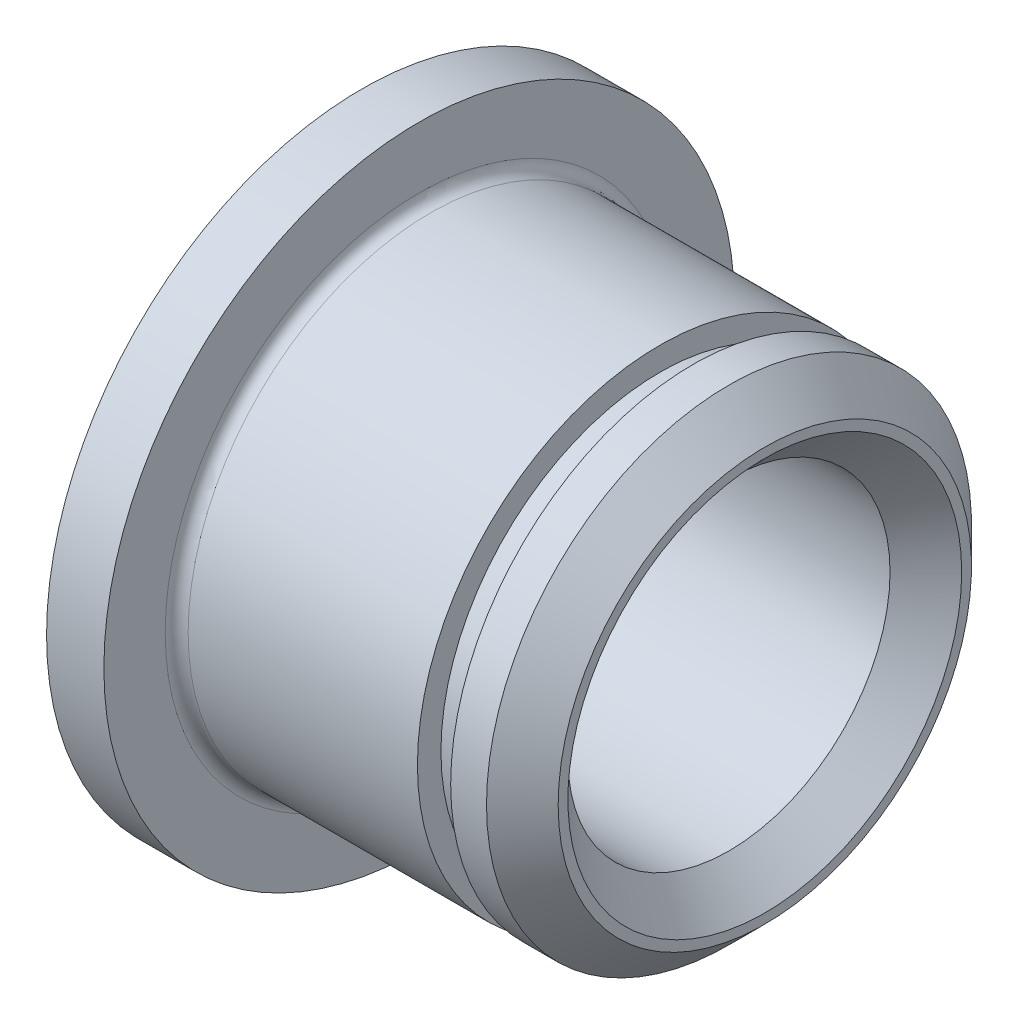
ISO-10303-21;
HEADER;
FILE_DESCRIPTION(('STEP AP214'),'2;1');
FILE_NAME('part.step','',(''),(''),'','','');
FILE_SCHEMA(('AUTOMOTIVE_DESIGN { 1 0 10303 214 1 1 1 1 }'));
ENDSEC;
DATA;
#1=APPLICATION_CONTEXT('core data for automotive mechanical design processes');
#2=APPLICATION_PROTOCOL_DEFINITION('international standard','automotive_design',2000,#1);
#3=PRODUCT_CONTEXT('',#1,'mechanical');
#4=PRODUCT('Part','Part','',(#3));
#5=PRODUCT_RELATED_PRODUCT_CATEGORY('part','',(#4));
#6=PRODUCT_DEFINITION_FORMATION('','',#4);
#7=PRODUCT_DEFINITION_CONTEXT('part definition',#1,'design');
#8=PRODUCT_DEFINITION('design','',#6,#7);
#9=PRODUCT_DEFINITION_SHAPE('','',#8);
#10=(LENGTH_UNIT() NAMED_UNIT(*) SI_UNIT(.MILLI.,.METRE.));
#11=(NAMED_UNIT(*) PLANE_ANGLE_UNIT() SI_UNIT($,.RADIAN.));
#12=(NAMED_UNIT(*) SI_UNIT($,.STERADIAN.) SOLID_ANGLE_UNIT());
#13=UNCERTAINTY_MEASURE_WITH_UNIT(LENGTH_MEASURE(1.E-05),#10,'distance_accuracy_value','');
#14=(GEOMETRIC_REPRESENTATION_CONTEXT(3) GLOBAL_UNCERTAINTY_ASSIGNED_CONTEXT((#13)) GLOBAL_UNIT_ASSIGNED_CONTEXT((#10,
#11,#12)) REPRESENTATION_CONTEXT('',''));
#15=CARTESIAN_POINT('',(0.,0.,0.));
#16=DIRECTION('',(0.,0.,1.));
#17=DIRECTION('',(1.,0.,0.));
#18=AXIS2_PLACEMENT_3D('',#15,#16,#17);
#19=CARTESIAN_POINT('',(7.3406,4.8514,0.));
#20=DIRECTION('',(1.,0.,0.));
#21=DIRECTION('',(0.,0.,-1.));
#22=AXIS2_PLACEMENT_3D('',#19,#20,#21);
#23=PLANE('',#22);
#24=CARTESIAN_POINT('',(7.3406,0.,0.));
#25=DIRECTION('',(-1.,0.,0.));
#26=DIRECTION('',(0.,0.,1.));
#27=AXIS2_PLACEMENT_3D('',#24,#25,#26);
#28=CIRCLE('',#27,5.3721);
#29=CARTESIAN_POINT('',(7.3406,0.,5.3721));
#30=VERTEX_POINT('',#29);
#31=EDGE_CURVE('E162',#30,#30,#28,.F.);
#32=ORIENTED_EDGE('',*,*,#31,.F.);
#33=EDGE_LOOP('',(#32));
#34=FACE_BOUND('',#33,.T.);
#35=CARTESIAN_POINT('',(7.3406,0.,0.));
#36=DIRECTION('',(-1.,0.,0.));
#37=DIRECTION('',(0.,0.,1.));
#38=AXIS2_PLACEMENT_3D('',#35,#36,#37);
#39=CIRCLE('',#38,4.8514);
#40=CARTESIAN_POINT('',(7.3406,0.,4.8514));
#41=VERTEX_POINT('',#40);
#42=EDGE_CURVE('E159',#41,#41,#39,.T.);
#43=ORIENTED_EDGE('',*,*,#42,.F.);
#44=EDGE_LOOP('',(#43));
#45=FACE_BOUND('',#44,.T.);
#46=ADVANCED_FACE('F16',(#34,#45),#23,.F.);
#47=CARTESIAN_POINT('',(0.,0.,0.));
#48=DIRECTION('',(-1.,0.,0.));
#49=DIRECTION('',(0.,0.,1.));
#50=AXIS2_PLACEMENT_3D('',#47,#48,#49);
#51=CYLINDRICAL_SURFACE('',#50,5.3721);
#52=ORIENTED_EDGE('',*,*,#31,.T.);
#53=EDGE_LOOP('',(#52));
#54=FACE_BOUND('',#53,.T.);
#55=CARTESIAN_POINT('',(8.13434999997753,0.,0.));
#56=DIRECTION('',(-1.,0.,0.));
#57=DIRECTION('',(0.,0.,1.));
#58=AXIS2_PLACEMENT_3D('',#55,#56,#57);
#59=CIRCLE('',#58,5.37209999993138);
#60=CARTESIAN_POINT('',(8.13434999997753,0.,5.37209999993138));
#61=VERTEX_POINT('',#60);
#62=EDGE_CURVE('E158',#61,#61,#59,.F.);
#63=ORIENTED_EDGE('',*,*,#62,.F.);
#64=EDGE_LOOP('',(#63));
#65=FACE_BOUND('',#64,.T.);
#66=ADVANCED_FACE('F89',(#54,#65),#51,.T.);
#67=CARTESIAN_POINT('',(0.,0.,0.));
#68=DIRECTION('',(-1.,0.,0.));
#69=DIRECTION('',(0.,0.,1.));
#70=AXIS2_PLACEMENT_3D('',#67,#68,#69);
#71=CYLINDRICAL_SURFACE('',#70,4.8514);
#72=CARTESIAN_POINT('',(6.604,0.,0.));
#73=DIRECTION('',(-1.,0.,0.));
#74=DIRECTION('',(0.,0.,1.));
#75=AXIS2_PLACEMENT_3D('',#72,#73,#74);
#76=CIRCLE('',#75,4.8514);
#77=CARTESIAN_POINT('',(6.604,0.,4.8514));
#78=VERTEX_POINT('',#77);
#79=EDGE_CURVE('E155',#78,#78,#76,.F.);
#80=ORIENTED_EDGE('',*,*,#79,.T.);
#81=EDGE_LOOP('',(#80));
#82=FACE_BOUND('',#81,.T.);
#83=ORIENTED_EDGE('',*,*,#42,.T.);
#84=EDGE_LOOP('',(#83));
#85=FACE_BOUND('',#84,.T.);
#86=ADVANCED_FACE('F86',(#82,#85),#71,.T.);
#87=CARTESIAN_POINT('',(8.13434999997753,0.,0.));
#88=DIRECTION('',(-1.,0.,0.));
#89=DIRECTION('',(0.,0.,1.));
#90=AXIS2_PLACEMENT_3D('',#87,#88,#89);
#91=CONICAL_SURFACE('',#90,5.37209999993138,0.785398163397448);
#92=ORIENTED_EDGE('',*,*,#62,.T.);
#93=EDGE_LOOP('',(#92));
#94=FACE_BOUND('',#93,.T.);
#95=CARTESIAN_POINT('',(8.9280999999346,0.,0.));
#96=DIRECTION('',(-1.,0.,0.));
#97=DIRECTION('',(0.,0.,1.));
#98=AXIS2_PLACEMENT_3D('',#95,#96,#97);
#99=CIRCLE('',#98,4.57834999997431);
#100=CARTESIAN_POINT('',(8.9280999999346,0.,4.57834999997431));
#101=VERTEX_POINT('',#100);
#102=EDGE_CURVE('E152',#101,#101,#99,.T.);
#103=ORIENTED_EDGE('',*,*,#102,.T.);
#104=EDGE_LOOP('',(#103));
#105=FACE_BOUND('',#104,.T.);
#106=ADVANCED_FACE('F82',(#94,#105),#91,.T.);
#107=CARTESIAN_POINT('',(6.604,5.3721,0.));
#108=DIRECTION('',(-1.,0.,0.));
#109=DIRECTION('',(0.,0.,1.));
#110=AXIS2_PLACEMENT_3D('',#107,#108,#109);
#111=PLANE('',#110);
#112=ORIENTED_EDGE('',*,*,#79,.F.);
#113=EDGE_LOOP('',(#112));
#114=FACE_BOUND('',#113,.T.);
#115=CARTESIAN_POINT('',(6.604,0.,0.));
#116=DIRECTION('',(-1.,0.,0.));
#117=DIRECTION('',(0.,0.,1.));
#118=AXIS2_PLACEMENT_3D('',#115,#116,#117);
#119=CIRCLE('',#118,5.3721);
#120=CARTESIAN_POINT('',(6.604,0.,5.3721));
#121=VERTEX_POINT('',#120);
#122=EDGE_CURVE('E149',#121,#121,#119,.T.);
#123=ORIENTED_EDGE('',*,*,#122,.F.);
#124=EDGE_LOOP('',(#123));
#125=FACE_BOUND('',#124,.T.);
#126=ADVANCED_FACE('F78',(#114,#125),#111,.F.);
#127=CARTESIAN_POINT('',(8.9281,4.57835,0.));
#128=DIRECTION('',(-1.,0.,0.));
#129=DIRECTION('',(0.,0.,1.));
#130=AXIS2_PLACEMENT_3D('',#127,#128,#129);
#131=PLANE('',#130);
#132=CARTESIAN_POINT('',(8.92809999999145,0.,0.));
#133=DIRECTION('',(1.,0.,0.));
#134=DIRECTION('',(0.,0.,-1.));
#135=AXIS2_PLACEMENT_3D('',#132,#133,#134);
#136=CIRCLE('',#135,4.36245000003055);
#137=CARTESIAN_POINT('',(8.92809999999145,0.,-4.36245000003055));
#138=VERTEX_POINT('',#137);
#139=EDGE_CURVE('E145',#138,#138,#136,.F.);
#140=ORIENTED_EDGE('',*,*,#139,.T.);
#141=EDGE_LOOP('',(#140));
#142=FACE_BOUND('',#141,.T.);
#143=ORIENTED_EDGE('',*,*,#102,.F.);
#144=EDGE_LOOP('',(#143));
#145=FACE_BOUND('',#144,.T.);
#146=ADVANCED_FACE('F74',(#142,#145),#131,.F.);
#147=CARTESIAN_POINT('',(0.,0.,0.));
#148=DIRECTION('',(-1.,0.,0.));
#149=DIRECTION('',(0.,0.,1.));
#150=AXIS2_PLACEMENT_3D('',#147,#148,#149);
#151=CYLINDRICAL_SURFACE('',#150,5.3721);
#152=CARTESIAN_POINT('',(1.524,0.,0.));
#153=DIRECTION('',(-1.,0.,0.));
#154=DIRECTION('',(0.,0.,1.));
#155=AXIS2_PLACEMENT_3D('',#152,#153,#154);
#156=CIRCLE('',#155,5.3721);
#157=CARTESIAN_POINT('',(1.524,0.,5.3721));
#158=VERTEX_POINT('',#157);
#159=EDGE_CURVE('E148',#158,#158,#156,.F.);
#160=ORIENTED_EDGE('',*,*,#159,.T.);
#161=EDGE_LOOP('',(#160));
#162=FACE_BOUND('',#161,.T.);
#163=ORIENTED_EDGE('',*,*,#122,.T.);
#164=EDGE_LOOP('',(#163));
#165=FACE_BOUND('',#164,.T.);
#166=ADVANCED_FACE('F70',(#162,#165),#151,.T.);
#167=CARTESIAN_POINT('',(8.92809999999145,0.,0.));
#168=DIRECTION('',(1.,0.,0.));
#169=DIRECTION('',(0.,0.,-1.));
#170=AXIS2_PLACEMENT_3D('',#167,#168,#169);
#171=CONICAL_SURFACE('',#170,4.36245000003055,0.785398163397448);
#172=CARTESIAN_POINT('',(8.13435,0.,0.));
#173=DIRECTION('',(-1.,0.,0.));
#174=DIRECTION('',(0.,0.,1.));
#175=AXIS2_PLACEMENT_3D('',#172,#173,#174);
#176=CIRCLE('',#175,3.5687);
#177=CARTESIAN_POINT('',(8.13435,0.,3.5687));
#178=VERTEX_POINT('',#177);
#179=EDGE_CURVE('E41',#178,#178,#176,.T.);
#180=ORIENTED_EDGE('',*,*,#179,.T.);
#181=EDGE_LOOP('',(#180));
#182=FACE_BOUND('',#181,.T.);
#183=ORIENTED_EDGE('',*,*,#139,.F.);
#184=EDGE_LOOP('',(#183));
#185=FACE_BOUND('',#184,.T.);
#186=ADVANCED_FACE('F65',(#182,#185),#171,.F.);
#187=CARTESIAN_POINT('',(1.524,0.,0.));
#188=DIRECTION('',(-1.,0.,0.));
#189=DIRECTION('',(0.,0.,1.));
#190=AXIS2_PLACEMENT_3D('',#187,#188,#189);
#191=TOROIDAL_SURFACE('',#190,5.6261,0.254);
#192=CARTESIAN_POINT('',(1.27,0.,0.));
#193=DIRECTION('',(1.,0.,0.));
#194=DIRECTION('',(0.,0.,-1.));
#195=AXIS2_PLACEMENT_3D('',#192,#193,#194);
#196=CIRCLE('',#195,5.6261);
#197=CARTESIAN_POINT('',(1.27,0.,-5.6261));
#198=VERTEX_POINT('',#197);
#199=CARTESIAN_POINT('',(1.27,0.,5.6261));
#200=VERTEX_POINT('',#199);
#201=EDGE_CURVE('E33',#198,#200,#196,.T.);
#202=ORIENTED_EDGE('',*,*,#201,.T.);
#203=CARTESIAN_POINT('',(1.27,0.,0.));
#204=DIRECTION('',(1.,0.,0.));
#205=DIRECTION('',(0.,0.,1.));
#206=AXIS2_PLACEMENT_3D('',#203,#204,#205);
#207=CIRCLE('',#206,5.6261);
#208=EDGE_CURVE('E36',#200,#198,#207,.T.);
#209=ORIENTED_EDGE('',*,*,#208,.T.);
#210=EDGE_LOOP('',(#202,#209));
#211=FACE_BOUND('',#210,.T.);
#212=ORIENTED_EDGE('',*,*,#159,.F.);
#213=EDGE_LOOP('',(#212));
#214=FACE_BOUND('',#213,.T.);
#215=ADVANCED_FACE('F44',(#211,#214),#191,.F.);
#216=CARTESIAN_POINT('',(0.,0.,0.));
#217=DIRECTION('',(-1.,0.,0.));
#218=DIRECTION('',(0.,0.,1.));
#219=AXIS2_PLACEMENT_3D('',#216,#217,#218);
#220=CYLINDRICAL_SURFACE('',#219,3.5687);
#221=ORIENTED_EDGE('',*,*,#179,.F.);
#222=EDGE_LOOP('',(#221));
#223=FACE_BOUND('',#222,.T.);
#224=CARTESIAN_POINT('',(0.793750000013915,0.,0.));
#225=DIRECTION('',(-1.,0.,0.));
#226=DIRECTION('',(0.,0.,1.));
#227=AXIS2_PLACEMENT_3D('',#224,#225,#226);
#228=CIRCLE('',#227,3.56870000001663);
#229=CARTESIAN_POINT('',(0.793750000013915,0.,3.56870000001663));
#230=VERTEX_POINT('',#229);
#231=EDGE_CURVE('E46',#230,#230,#228,.T.);
#232=ORIENTED_EDGE('',*,*,#231,.T.);
#233=EDGE_LOOP('',(#232));
#234=FACE_BOUND('',#233,.T.);
#235=ADVANCED_FACE('F64',(#223,#234),#220,.F.);
#236=CARTESIAN_POINT('',(1.27,6.985,0.));
#237=DIRECTION('',(-1.,0.,0.));
#238=DIRECTION('',(0.,0.,1.));
#239=AXIS2_PLACEMENT_3D('',#236,#237,#238);
#240=PLANE('',#239);
#241=ORIENTED_EDGE('',*,*,#208,.F.);
#242=ORIENTED_EDGE('',*,*,#201,.F.);
#243=EDGE_LOOP('',(#241,#242));
#244=FACE_BOUND('',#243,.T.);
#245=CARTESIAN_POINT('',(1.27,0.,0.));
#246=DIRECTION('',(-1.,0.,0.));
#247=DIRECTION('',(0.,0.,1.));
#248=AXIS2_PLACEMENT_3D('',#245,#246,#247);
#249=CIRCLE('',#248,6.985);
#250=CARTESIAN_POINT('',(1.27,0.,6.985));
#251=VERTEX_POINT('',#250);
#252=EDGE_CURVE('E135',#251,#251,#249,.T.);
#253=ORIENTED_EDGE('',*,*,#252,.F.);
#254=EDGE_LOOP('',(#253));
#255=FACE_BOUND('',#254,.T.);
#256=ADVANCED_FACE('F38',(#244,#255),#240,.F.);
#257=CARTESIAN_POINT('',(1.13686837721616E-10,0.,0.));
#258=DIRECTION('',(-1.,0.,0.));
#259=DIRECTION('',(0.,0.,1.));
#260=AXIS2_PLACEMENT_3D('',#257,#258,#259);
#261=CONICAL_SURFACE('',#260,4.36244999986002,0.785398163397448);
#262=ORIENTED_EDGE('',*,*,#231,.F.);
#263=EDGE_LOOP('',(#262));
#264=FACE_BOUND('',#263,.T.);
#265=CARTESIAN_POINT('',(0.,0.,0.));
#266=DIRECTION('',(-1.,0.,0.));
#267=DIRECTION('',(0.,0.,1.));
#268=AXIS2_PLACEMENT_3D('',#265,#266,#267);
#269=CIRCLE('',#268,4.36244999997371);
#270=CARTESIAN_POINT('',(0.,0.,4.36244999997371));
#271=VERTEX_POINT('',#270);
#272=EDGE_CURVE('E27',#271,#271,#269,.T.);
#273=ORIENTED_EDGE('',*,*,#272,.T.);
#274=EDGE_LOOP('',(#273));
#275=FACE_BOUND('',#274,.T.);
#276=ADVANCED_FACE('F108',(#264,#275),#261,.F.);
#277=CARTESIAN_POINT('',(0.,0.,0.));
#278=DIRECTION('',(-1.,0.,0.));
#279=DIRECTION('',(0.,0.,1.));
#280=AXIS2_PLACEMENT_3D('',#277,#278,#279);
#281=CYLINDRICAL_SURFACE('',#280,6.985);
#282=CARTESIAN_POINT('',(0.,0.,0.));
#283=DIRECTION('',(-1.,0.,0.));
#284=DIRECTION('',(0.,0.,1.));
#285=AXIS2_PLACEMENT_3D('',#282,#283,#284);
#286=CIRCLE('',#285,6.985);
#287=CARTESIAN_POINT('',(0.,0.,6.985));
#288=VERTEX_POINT('',#287);
#289=EDGE_CURVE('E10',#288,#288,#286,.F.);
#290=ORIENTED_EDGE('',*,*,#289,.T.);
#291=EDGE_LOOP('',(#290));
#292=FACE_BOUND('',#291,.T.);
#293=ORIENTED_EDGE('',*,*,#252,.T.);
#294=EDGE_LOOP('',(#293));
#295=FACE_BOUND('',#294,.T.);
#296=ADVANCED_FACE('F102',(#292,#295),#281,.T.);
#297=CARTESIAN_POINT('',(0.,4.36245,0.));
#298=DIRECTION('',(1.,0.,0.));
#299=DIRECTION('',(0.,0.,-1.));
#300=AXIS2_PLACEMENT_3D('',#297,#298,#299);
#301=PLANE('',#300);
#302=ORIENTED_EDGE('',*,*,#289,.F.);
#303=EDGE_LOOP('',(#302));
#304=FACE_BOUND('',#303,.T.);
#305=ORIENTED_EDGE('',*,*,#272,.F.);
#306=EDGE_LOOP('',(#305));
#307=FACE_BOUND('',#306,.T.);
#308=ADVANCED_FACE('F100',(#304,#307),#301,.F.);
#309=CLOSED_SHELL('',(#46,#66,#86,#106,#126,#146,#166,#186,#215,#235,#256,#276,#296,#308));
#310=MANIFOLD_SOLID_BREP('B1',#309);
#311=ADVANCED_BREP_SHAPE_REPRESENTATION('',(#18,#310),#14);
#312=SHAPE_DEFINITION_REPRESENTATION(#9,#311);
ENDSEC;
END-ISO-10303-21;
